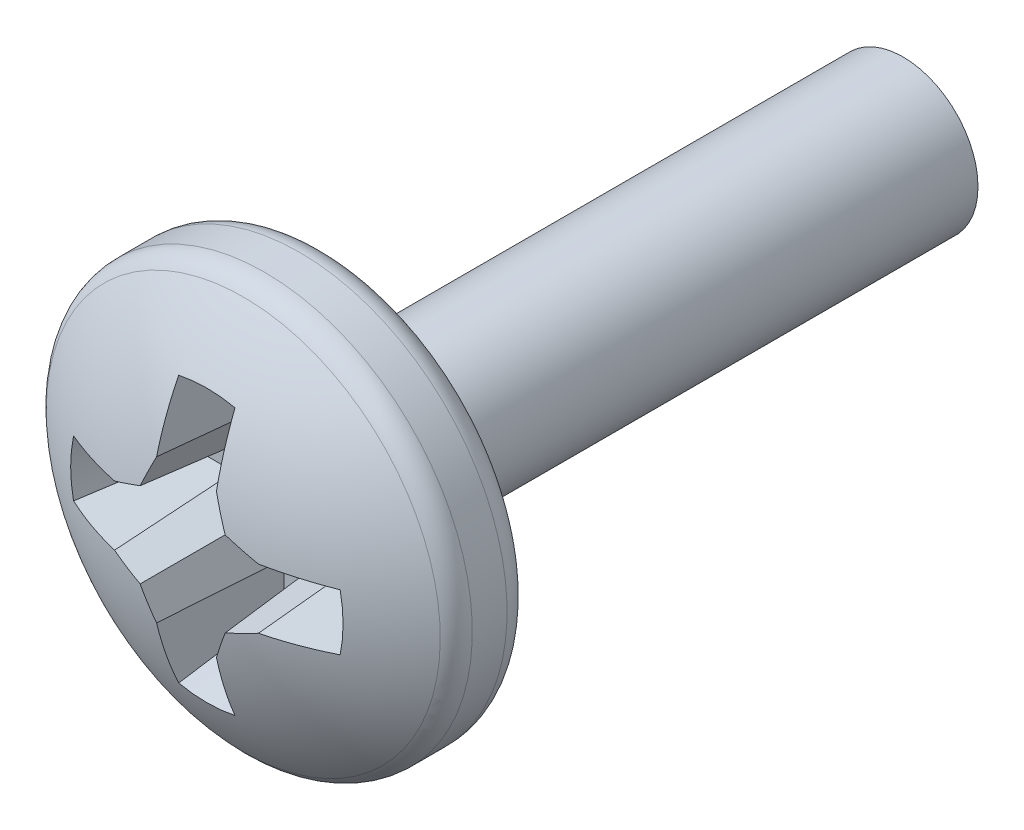
ISO-10303-21;
HEADER;
FILE_DESCRIPTION(('STEP AP214'),'2;1');
FILE_NAME('part.step','',(''),(''),'','','');
FILE_SCHEMA(('AUTOMOTIVE_DESIGN { 1 0 10303 214 1 1 1 1 }'));
ENDSEC;
DATA;
#1=APPLICATION_CONTEXT('core data for automotive mechanical design processes');
#2=APPLICATION_PROTOCOL_DEFINITION('international standard','automotive_design',2000,#1);
#3=PRODUCT_CONTEXT('',#1,'mechanical');
#4=PRODUCT('Part','Part','',(#3));
#5=PRODUCT_RELATED_PRODUCT_CATEGORY('part','',(#4));
#6=PRODUCT_DEFINITION_FORMATION('','',#4);
#7=PRODUCT_DEFINITION_CONTEXT('part definition',#1,'design');
#8=PRODUCT_DEFINITION('design','',#6,#7);
#9=PRODUCT_DEFINITION_SHAPE('','',#8);
#10=(LENGTH_UNIT() NAMED_UNIT(*) SI_UNIT(.MILLI.,.METRE.));
#11=(NAMED_UNIT(*) PLANE_ANGLE_UNIT() SI_UNIT($,.RADIAN.));
#12=(NAMED_UNIT(*) SI_UNIT($,.STERADIAN.) SOLID_ANGLE_UNIT());
#13=UNCERTAINTY_MEASURE_WITH_UNIT(LENGTH_MEASURE(1.E-05),#10,'distance_accuracy_value','');
#14=(GEOMETRIC_REPRESENTATION_CONTEXT(3) GLOBAL_UNCERTAINTY_ASSIGNED_CONTEXT((#13)) GLOBAL_UNIT_ASSIGNED_CONTEXT((#10,
#11,#12)) REPRESENTATION_CONTEXT('',''));
#15=CARTESIAN_POINT('',(0.,0.,0.));
#16=DIRECTION('',(0.,0.,1.));
#17=DIRECTION('',(1.,0.,0.));
#18=AXIS2_PLACEMENT_3D('',#15,#16,#17);
#19=CARTESIAN_POINT('',(0.,0.,9.525));
#20=DIRECTION('',(0.,0.,-1.));
#21=DIRECTION('',(-1.,0.,0.));
#22=AXIS2_PLACEMENT_3D('',#19,#20,#21);
#23=PLANE('',#22);
#24=CARTESIAN_POINT('',(0.,0.,9.525));
#25=DIRECTION('',(0.,0.,1.));
#26=DIRECTION('',(1.,0.,0.));
#27=AXIS2_PLACEMENT_3D('',#24,#25,#26);
#28=CIRCLE('',#27,1.23704425180958);
#29=CARTESIAN_POINT('',(1.23704425180958,0.,9.525));
#30=VERTEX_POINT('',#29);
#31=EDGE_CURVE('E491',#30,#30,#28,.T.);
#32=ORIENTED_EDGE('',*,*,#31,.T.);
#33=EDGE_LOOP('',(#32));
#34=FACE_BOUND('',#33,.T.);
#35=CARTESIAN_POINT('',(0.,0.,9.525));
#36=DIRECTION('',(0.,0.,1.));
#37=DIRECTION('',(0.,-1.,0.));
#38=AXIS2_PLACEMENT_3D('',#35,#36,#37);
#39=CIRCLE('',#38,2.985516);
#40=CARTESIAN_POINT('',(0.,-2.985516,9.525));
#41=VERTEX_POINT('',#40);
#42=EDGE_CURVE('E473',#41,#41,#39,.T.);
#43=ORIENTED_EDGE('',*,*,#42,.F.);
#44=EDGE_LOOP('',(#43));
#45=FACE_BOUND('',#44,.T.);
#46=ADVANCED_FACE('F34',(#34,#45),#23,.T.);
#47=CARTESIAN_POINT('',(0.,0.,0.));
#48=DIRECTION('',(0.,0.,1.));
#49=DIRECTION('',(1.,0.,0.));
#50=AXIS2_PLACEMENT_3D('',#47,#48,#49);
#51=CYLINDRICAL_SURFACE('',#50,1.23704425180958);
#52=CARTESIAN_POINT('',(0.,0.,0.));
#53=DIRECTION('',(0.,0.,1.));
#54=DIRECTION('',(1.,0.,0.));
#55=AXIS2_PLACEMENT_3D('',#52,#53,#54);
#56=CIRCLE('',#55,1.23704425180958);
#57=CARTESIAN_POINT('',(1.23704425180958,0.,0.));
#58=VERTEX_POINT('',#57);
#59=EDGE_CURVE('E452',#58,#58,#56,.T.);
#60=ORIENTED_EDGE('',*,*,#59,.T.);
#61=EDGE_LOOP('',(#60));
#62=FACE_BOUND('',#61,.T.);
#63=ORIENTED_EDGE('',*,*,#31,.F.);
#64=EDGE_LOOP('',(#63));
#65=FACE_BOUND('',#64,.T.);
#66=ADVANCED_FACE('F297',(#62,#65),#51,.T.);
#67=CARTESIAN_POINT('',(0.,0.,0.));
#68=DIRECTION('',(0.,0.,1.));
#69=DIRECTION('',(1.,0.,0.));
#70=AXIS2_PLACEMENT_3D('',#67,#68,#69);
#71=PLANE('',#70);
#72=ORIENTED_EDGE('',*,*,#59,.F.);
#73=EDGE_LOOP('',(#72));
#74=FACE_BOUND('',#73,.T.);
#75=ADVANCED_FACE('F303',(#74),#71,.F.);
#76=CARTESIAN_POINT('',(0.,0.,9.968484));
#77=DIRECTION('',(0.,0.,1.));
#78=DIRECTION('',(0.,-1.,0.));
#79=AXIS2_PLACEMENT_3D('',#76,#77,#78);
#80=TOROIDAL_SURFACE('',#79,2.985516,0.443484);
#81=ORIENTED_EDGE('',*,*,#42,.T.);
#82=EDGE_LOOP('',(#81));
#83=FACE_BOUND('',#82,.T.);
#84=CARTESIAN_POINT('',(0.,0.,9.968484));
#85=DIRECTION('',(0.,0.,1.));
#86=DIRECTION('',(0.,-1.,0.));
#87=AXIS2_PLACEMENT_3D('',#84,#85,#86);
#88=CIRCLE('',#87,3.429);
#89=CARTESIAN_POINT('',(0.,-3.429,9.968484));
#90=VERTEX_POINT('',#89);
#91=EDGE_CURVE('E475',#90,#90,#88,.T.);
#92=ORIENTED_EDGE('',*,*,#91,.F.);
#93=EDGE_LOOP('',(#92));
#94=FACE_BOUND('',#93,.T.);
#95=ADVANCED_FACE('F313',(#83,#94),#80,.T.);
#96=CARTESIAN_POINT('',(0.,0.,0.));
#97=DIRECTION('',(0.,0.,-1.));
#98=DIRECTION('',(-1.,0.,0.));
#99=AXIS2_PLACEMENT_3D('',#96,#97,#98);
#100=CYLINDRICAL_SURFACE('',#99,3.429);
#101=ORIENTED_EDGE('',*,*,#91,.T.);
#102=EDGE_LOOP('',(#101));
#103=FACE_BOUND('',#102,.T.);
#104=CARTESIAN_POINT('',(0.,0.,10.5423064995387));
#105=DIRECTION('',(0.,0.,1.));
#106=DIRECTION('',(0.,-1.,0.));
#107=AXIS2_PLACEMENT_3D('',#104,#105,#106);
#108=CIRCLE('',#107,3.429);
#109=CARTESIAN_POINT('',(0.,-3.429,10.5423064995387));
#110=VERTEX_POINT('',#109);
#111=EDGE_CURVE('E498',#110,#110,#108,.T.);
#112=ORIENTED_EDGE('',*,*,#111,.F.);
#113=EDGE_LOOP('',(#112));
#114=FACE_BOUND('',#113,.T.);
#115=ADVANCED_FACE('F311',(#103,#114),#100,.T.);
#116=CARTESIAN_POINT('',(0.,0.,6.60053041237114));
#117=DIRECTION('',(0.,0.,1.));
#118=DIRECTION('',(0.,1.,0.));
#119=AXIS2_PLACEMENT_3D('',#116,#117,#118);
#120=SPHERICAL_SURFACE('',#119,5.38826958762886);
#121=CARTESIAN_POINT('',(0.,0.,11.4968097698319));
#122=DIRECTION('',(0.,0.,-1.));
#123=DIRECTION('',(-1.,0.,0.));
#124=AXIS2_PLACEMENT_3D('',#121,#122,#123);
#125=CIRCLE('',#124,2.24942161514245);
#126=CARTESIAN_POINT('',(2.20084372883168,-0.46495643229479,11.4968097698319));
#127=VERTEX_POINT('',#126);
#128=CARTESIAN_POINT('',(2.20084372883169,0.464956432294775,11.4968097698319));
#129=VERTEX_POINT('',#128);
#130=EDGE_CURVE('E450',#127,#129,#125,.F.);
#131=ORIENTED_EDGE('',*,*,#130,.F.);
#132=CARTESIAN_POINT('',(0.,-0.036309571930155,6.59735373644977));
#133=DIRECTION('',(0.,0.996194698091746,0.0871557427476587));
#134=DIRECTION('',(0.,-0.0871557427476587,0.996194698091746));
#135=AXIS2_PLACEMENT_3D('',#132,#133,#134);
#136=CIRCLE('',#135,5.38814631136558);
#137=CARTESIAN_POINT('',(1.18791231699318,-0.494362421590186,11.8329217654927));
#138=VERTEX_POINT('',#137);
#139=EDGE_CURVE('E11',#138,#127,#136,.T.);
#140=ORIENTED_EDGE('',*,*,#139,.F.);
#141=CARTESIAN_POINT('',(0.172247929781571,-0.415843288169375,6.56115128096071));
#142=DIRECTION('',(-0.381227206369642,0.920363891963229,0.0871557427476588));
#143=DIRECTION('',(-0.923879532511292,-0.382683432365078,0.));
#144=AXIS2_PLACEMENT_3D('',#141,#142,#143);
#145=CIRCLE('',#144,5.36929263901177);
#146=CARTESIAN_POINT('',(0.701763399312058,-0.701763399312065,11.8966143818469));
#147=VERTEX_POINT('',#146);
#148=EDGE_CURVE('E44',#147,#138,#145,.T.);
#149=ORIENTED_EDGE('',*,*,#148,.F.);
#150=CARTESIAN_POINT('',(0.415843288169372,-0.172247929781579,6.56115128096071));
#151=DIRECTION('',(-0.920363891963226,0.381227206369651,0.0871557427476588));
#152=DIRECTION('',(-0.382683432365087,-0.923879532511288,0.));
#153=AXIS2_PLACEMENT_3D('',#150,#151,#152);
#154=CIRCLE('',#153,5.36929263901177);
#155=CARTESIAN_POINT('',(0.494362421590174,-1.18791231699318,11.8329217654927));
#156=VERTEX_POINT('',#155);
#157=EDGE_CURVE('E358',#156,#147,#154,.T.);
#158=ORIENTED_EDGE('',*,*,#157,.F.);
#159=CARTESIAN_POINT('',(0.0363095719301513,0.,6.59735373644977));
#160=DIRECTION('',(-0.996194698091746,0.,0.0871557427476587));
#161=DIRECTION('',(0.0871557427476587,0.,0.996194698091746));
#162=AXIS2_PLACEMENT_3D('',#159,#160,#161);
#163=CIRCLE('',#162,5.38814631136558);
#164=CARTESIAN_POINT('',(0.464956432294771,-2.20084372883169,11.4968097698319));
#165=VERTEX_POINT('',#164);
#166=EDGE_CURVE('E366',#165,#156,#163,.T.);
#167=ORIENTED_EDGE('',*,*,#166,.F.);
#168=CARTESIAN_POINT('',(0.,0.,11.4968097698319));
#169=DIRECTION('',(0.,0.,-1.));
#170=DIRECTION('',(0.,1.,0.));
#171=AXIS2_PLACEMENT_3D('',#168,#169,#170);
#172=CIRCLE('',#171,2.24942161514245);
#173=CARTESIAN_POINT('',(-0.464956432294793,-2.20084372883169,11.4968097698319));
#174=VERTEX_POINT('',#173);
#175=EDGE_CURVE('E262',#174,#165,#172,.F.);
#176=ORIENTED_EDGE('',*,*,#175,.F.);
#177=CARTESIAN_POINT('',(-0.0363095719301525,0.,6.59735373644977));
#178=DIRECTION('',(0.996194698091746,0.,0.0871557427476584));
#179=DIRECTION('',(0.0871557427476584,0.,-0.996194698091746));
#180=AXIS2_PLACEMENT_3D('',#177,#178,#179);
#181=CIRCLE('',#180,5.38814631136558);
#182=CARTESIAN_POINT('',(-0.494362421590186,-1.18791231699318,11.8329217654927));
#183=VERTEX_POINT('',#182);
#184=EDGE_CURVE('E260',#183,#174,#181,.T.);
#185=ORIENTED_EDGE('',*,*,#184,.F.);
#186=CARTESIAN_POINT('',(-0.415843288169373,-0.172247929781572,6.56115128096071));
#187=DIRECTION('',(0.920363891963231,0.381227206369638,0.0871557427476587));
#188=DIRECTION('',(-0.382683432365075,0.923879532511293,0.));
#189=AXIS2_PLACEMENT_3D('',#186,#187,#188);
#190=CIRCLE('',#189,5.36929263901177);
#191=CARTESIAN_POINT('',(-0.701763399312063,-0.70176339931206,11.8966143818469));
#192=VERTEX_POINT('',#191);
#193=EDGE_CURVE('E263',#192,#183,#190,.T.);
#194=ORIENTED_EDGE('',*,*,#193,.F.);
#195=CARTESIAN_POINT('',(-0.172247929781577,-0.415843288169374,6.56115128096071));
#196=DIRECTION('',(0.381227206369654,0.920363891963224,0.0871557427476591));
#197=DIRECTION('',(-0.923879532511287,0.38268343236509,0.));
#198=AXIS2_PLACEMENT_3D('',#195,#196,#197);
#199=CIRCLE('',#198,5.36929263901177);
#200=CARTESIAN_POINT('',(-1.18791231699318,-0.494362421590174,11.8329217654927));
#201=VERTEX_POINT('',#200);
#202=EDGE_CURVE('E265',#201,#192,#199,.T.);
#203=ORIENTED_EDGE('',*,*,#202,.F.);
#204=CARTESIAN_POINT('',(0.,-0.0363095719301537,6.59735373644977));
#205=DIRECTION('',(0.,0.996194698091745,0.0871557427476591));
#206=DIRECTION('',(0.,-0.0871557427476591,0.996194698091745));
#207=AXIS2_PLACEMENT_3D('',#204,#205,#206);
#208=CIRCLE('',#207,5.38814631136558);
#209=CARTESIAN_POINT('',(-2.20084372883169,-0.464956432294768,11.4968097698319));
#210=VERTEX_POINT('',#209);
#211=EDGE_CURVE('E230',#210,#201,#208,.T.);
#212=ORIENTED_EDGE('',*,*,#211,.F.);
#213=CARTESIAN_POINT('',(0.,0.,11.4968097698319));
#214=DIRECTION('',(0.,0.,-1.));
#215=DIRECTION('',(-1.,0.,0.));
#216=AXIS2_PLACEMENT_3D('',#213,#214,#215);
#217=CIRCLE('',#216,2.24942161514245);
#218=CARTESIAN_POINT('',(-2.20084372883168,0.464956432294797,11.4968097698319));
#219=VERTEX_POINT('',#218);
#220=EDGE_CURVE('E187',#219,#210,#217,.F.);
#221=ORIENTED_EDGE('',*,*,#220,.F.);
#222=CARTESIAN_POINT('',(0.,0.0363095719301501,6.59735373644977));
#223=DIRECTION('',(0.,-0.996194698091746,0.087155742747658));
#224=DIRECTION('',(0.,-0.087155742747658,-0.996194698091746));
#225=AXIS2_PLACEMENT_3D('',#222,#223,#224);
#226=CIRCLE('',#225,5.38814631136558);
#227=CARTESIAN_POINT('',(-1.18791231699317,0.494362421590185,11.8329217654927));
#228=VERTEX_POINT('',#227);
#229=EDGE_CURVE('E184',#228,#219,#226,.T.);
#230=ORIENTED_EDGE('',*,*,#229,.F.);
#231=CARTESIAN_POINT('',(-0.172247929781568,0.415843288169371,6.56115128096071));
#232=DIRECTION('',(0.381227206369635,-0.920363891963232,0.0871557427476582));
#233=DIRECTION('',(0.923879532511294,0.382683432365071,0.));
#234=AXIS2_PLACEMENT_3D('',#231,#232,#233);
#235=CIRCLE('',#234,5.36929263901177);
#236=CARTESIAN_POINT('',(-0.701763399312053,0.701763399312061,11.8966143818469));
#237=VERTEX_POINT('',#236);
#238=EDGE_CURVE('E183',#237,#228,#235,.T.);
#239=ORIENTED_EDGE('',*,*,#238,.F.);
#240=CARTESIAN_POINT('',(-0.415843288169371,0.172247929781576,6.56115128096071));
#241=DIRECTION('',(0.920363891963223,-0.381227206369657,0.0871557427476586));
#242=DIRECTION('',(0.382683432365093,0.923879532511285,0.));
#243=AXIS2_PLACEMENT_3D('',#240,#241,#242);
#244=CIRCLE('',#243,5.36929263901177);
#245=CARTESIAN_POINT('',(-0.494362421590166,1.18791231699318,11.8329217654927));
#246=VERTEX_POINT('',#245);
#247=EDGE_CURVE('E38',#246,#237,#244,.T.);
#248=ORIENTED_EDGE('',*,*,#247,.F.);
#249=CARTESIAN_POINT('',(-0.0363095719301513,0.,6.59735373644977));
#250=DIRECTION('',(0.996194698091746,0.,0.0871557427476587));
#251=DIRECTION('',(0.0871557427476587,0.,-0.996194698091746));
#252=AXIS2_PLACEMENT_3D('',#249,#250,#251);
#253=CIRCLE('',#252,5.38814631136558);
#254=CARTESIAN_POINT('',(-0.464956432294756,2.20084372883169,11.4968097698319));
#255=VERTEX_POINT('',#254);
#256=EDGE_CURVE('E162',#255,#246,#253,.T.);
#257=ORIENTED_EDGE('',*,*,#256,.F.);
#258=CARTESIAN_POINT('',(0.,0.,11.4968097698319));
#259=DIRECTION('',(0.,0.,-1.));
#260=DIRECTION('',(-1.,0.,0.));
#261=AXIS2_PLACEMENT_3D('',#258,#259,#260);
#262=CIRCLE('',#261,2.24942161514245);
#263=CARTESIAN_POINT('',(0.464956432294778,2.20084372883168,11.4968097698319));
#264=VERTEX_POINT('',#263);
#265=EDGE_CURVE('E171',#264,#255,#262,.F.);
#266=ORIENTED_EDGE('',*,*,#265,.F.);
#267=CARTESIAN_POINT('',(0.0363095719301525,0.,6.59735373644977));
#268=DIRECTION('',(-0.996194698091746,0.,0.0871557427476584));
#269=DIRECTION('',(0.0871557427476584,0.,0.996194698091746));
#270=AXIS2_PLACEMENT_3D('',#267,#268,#269);
#271=CIRCLE('',#270,5.38814631136558);
#272=CARTESIAN_POINT('',(0.494362421590177,1.18791231699318,11.8329217654927));
#273=VERTEX_POINT('',#272);
#274=EDGE_CURVE('E53',#273,#264,#271,.T.);
#275=ORIENTED_EDGE('',*,*,#274,.F.);
#276=CARTESIAN_POINT('',(0.415843288169372,0.17224792978157,6.56115128096071));
#277=DIRECTION('',(-0.920363891963228,-0.381227206369645,0.0871557427476584));
#278=DIRECTION('',(0.382683432365081,-0.92387953251129,0.));
#279=AXIS2_PLACEMENT_3D('',#276,#277,#278);
#280=CIRCLE('',#279,5.36929263901177);
#281=CARTESIAN_POINT('',(0.701763399312058,0.701763399312056,11.8966143818469));
#282=VERTEX_POINT('',#281);
#283=EDGE_CURVE('E435',#282,#273,#280,.T.);
#284=ORIENTED_EDGE('',*,*,#283,.F.);
#285=CARTESIAN_POINT('',(0.172247929781574,0.41584328816937,6.56115128096071));
#286=DIRECTION('',(-0.381227206369648,-0.920363891963227,0.0871557427476584));
#287=DIRECTION('',(0.923879532511289,-0.382683432365084,0.));
#288=AXIS2_PLACEMENT_3D('',#285,#286,#287);
#289=CIRCLE('',#288,5.36929263901177);
#290=CARTESIAN_POINT('',(1.18791231699318,0.494362421590174,11.8329217654927));
#291=VERTEX_POINT('',#290);
#292=EDGE_CURVE('E437',#291,#282,#289,.T.);
#293=ORIENTED_EDGE('',*,*,#292,.F.);
#294=CARTESIAN_POINT('',(0.,0.0363095719301488,6.59735373644977));
#295=DIRECTION('',(0.,-0.996194698091746,0.0871557427476584));
#296=DIRECTION('',(0.,-0.0871557427476584,-0.996194698091746));
#297=AXIS2_PLACEMENT_3D('',#294,#295,#296);
#298=CIRCLE('',#297,5.38814631136558);
#299=EDGE_CURVE('E447',#129,#291,#298,.T.);
#300=ORIENTED_EDGE('',*,*,#299,.F.);
#301=EDGE_LOOP('',(#131,#140,#149,#158,#167,#176,#185,#194,#203,#212,#221,#230,#239,#248,#257,
#266,#275,#284,#293,#300));
#302=FACE_BOUND('',#301,.T.);
#303=CARTESIAN_POINT('',(0.,0.,10.8958333805859));
#304=DIRECTION('',(0.,0.,1.));
#305=DIRECTION('',(0.,-1.,0.));
#306=AXIS2_PLACEMENT_3D('',#303,#304,#305);
#307=CIRCLE('',#306,3.25327858632053);
#308=CARTESIAN_POINT('',(0.,-3.25327858632054,10.8958333805859));
#309=VERTEX_POINT('',#308);
#310=EDGE_CURVE('E493',#309,#309,#307,.T.);
#311=ORIENTED_EDGE('',*,*,#310,.T.);
#312=EDGE_LOOP('',(#311));
#313=FACE_BOUND('',#312,.T.);
#314=ADVANCED_FACE('F180',(#302,#313),#120,.T.);
#315=CARTESIAN_POINT('',(0.,0.,10.5423064995387));
#316=DIRECTION('',(0.,0.,1.));
#317=DIRECTION('',(0.,-1.,0.));
#318=AXIS2_PLACEMENT_3D('',#315,#316,#317);
#319=TOROIDAL_SURFACE('',#318,2.985516,0.443484000000001);
#320=ORIENTED_EDGE('',*,*,#111,.T.);
#321=EDGE_LOOP('',(#320));
#322=FACE_BOUND('',#321,.T.);
#323=ORIENTED_EDGE('',*,*,#310,.F.);
#324=EDGE_LOOP('',(#323));
#325=FACE_BOUND('',#324,.T.);
#326=ADVANCED_FACE('F511',(#322,#325),#319,.T.);
#327=CARTESIAN_POINT('',(0.,0.,11.9888));
#328=DIRECTION('',(0.,0.,1.));
#329=DIRECTION('',(1.,0.,0.));
#330=AXIS2_PLACEMENT_3D('',#327,#328,#329);
#331=CONICAL_SURFACE('',#330,2.38125,0.26179938779915);
#332=ORIENTED_EDGE('',*,*,#265,.T.);
#333=CARTESIAN_POINT('',(-0.0367245839476239,0.937168091106453,6.60209734551587));
#334=CARTESIAN_POINT('',(-0.0515729130404379,0.982084876550983,6.77181452365535));
#335=CARTESIAN_POINT('',(-0.0664265517163799,1.02676943487832,6.94159239060769));
#336=CARTESIAN_POINT('',(-0.0961417507909936,1.11578945940655,7.2812386702175));
#337=CARTESIAN_POINT('',(-0.111003311176656,1.16012492617887,7.45110708272627));
#338=CARTESIAN_POINT('',(-0.155595811353238,1.29278068215684,7.9608016920555));
#339=CARTESIAN_POINT('',(-0.185334660454623,1.38075059865527,8.30071829270827));
#340=CARTESIAN_POINT('',(-0.244823791842432,1.55617358705389,8.98068217591679));
#341=CARTESIAN_POINT('',(-0.274574074083562,1.6436266609796,9.32072945795483));
#342=CARTESIAN_POINT('',(-0.334081806184161,1.81821208383946,10.0009059482834));
#343=CARTESIAN_POINT('',(-0.363839256048535,1.90534443255342,10.34103515663));
#344=CARTESIAN_POINT('',(-0.405491259074873,2.02714740848223,10.8171197297358));
#345=CARTESIAN_POINT('',(-0.417383839482949,2.06190690410988,10.9530525458149));
#346=CARTESIAN_POINT('',(-0.441169663877477,2.13139639003621,11.2249257627087));
#347=CARTESIAN_POINT('',(-0.453062907864384,2.1661263803144,11.3608661635286));
#348=CARTESIAN_POINT('',(-0.464956432294756,2.20084372883169,11.4968097698319));
#349=B_SPLINE_CURVE_WITH_KNOTS('',3,(#333,#334,#335,#336,#337,#338,#339,#340,#341,#342,#343,
#344,#345,#346,#347,#348),.UNSPECIFIED.,.F.,.F.,(4,2,2,2,2,2,2,4),(0.,0.52856085438551,
1.05712084340582,2.11423760848944,3.17135022794478,4.22846357303555,4.65089283057721,
5.07332238123299),.UNSPECIFIED.);
#350=CARTESIAN_POINT('',(-0.324778616184085,1.79089165428426,9.89457));
#351=VERTEX_POINT('',#350);
#352=EDGE_CURVE('E168',#351,#255,#349,.T.);
#353=ORIENTED_EDGE('',*,*,#352,.F.);
#354=CARTESIAN_POINT('',(0.,0.,9.89457));
#355=DIRECTION('',(0.,0.,1.));
#356=DIRECTION('',(1.,0.,0.));
#357=AXIS2_PLACEMENT_3D('',#354,#355,#356);
#358=CIRCLE('',#357,1.82010276273497);
#359=CARTESIAN_POINT('',(0.324778616184104,1.79089165428426,9.89457));
#360=VERTEX_POINT('',#359);
#361=EDGE_CURVE('E268',#360,#351,#358,.T.);
#362=ORIENTED_EDGE('',*,*,#361,.F.);
#363=CARTESIAN_POINT('',(0.324778616184104,1.79089165428426,9.89457));
#364=CARTESIAN_POINT('',(0.345127887711346,1.85053906967391,10.1271632378795));
#365=CARTESIAN_POINT('',(0.365478613282524,1.91012112516936,10.3597730955572));
#366=CARTESIAN_POINT('',(0.406182392639911,2.02918033466595,10.8250194225322));
#367=CARTESIAN_POINT('',(0.426535446425826,2.08865748868039,11.0576558918261));
#368=CARTESIAN_POINT('',(0.467243306320348,2.20753272517559,11.522948859554));
#369=CARTESIAN_POINT('',(0.487598112428854,2.26693080766093,11.7556053579867));
#370=CARTESIAN_POINT('',(0.528309135408767,2.38566341836104,12.2209344799461));
#371=CARTESIAN_POINT('',(0.548665352280352,2.44499794656782,12.4536071034746));
#372=CARTESIAN_POINT('',(0.569022100605802,2.50430844707825,12.6862858015487));
#373=B_SPLINE_CURVE_WITH_KNOTS('',3,(#363,#364,#365,#366,#367,#368,#369,#370,#371,#372),
.UNSPECIFIED.,.F.,.F.,(4,2,2,2,4),(0.,0.722940972625731,1.44588185359085,2.16882269264757,
2.89176362255185),.UNSPECIFIED.);
#374=EDGE_CURVE('E432',#360,#264,#373,.T.);
#375=ORIENTED_EDGE('',*,*,#374,.T.);
#376=EDGE_LOOP('',(#332,#353,#362,#375));
#377=FACE_BOUND('',#376,.T.);
#378=ADVANCED_FACE('F284',(#377),#331,.F.);
#379=CARTESIAN_POINT('',(0.508,0.,11.9888));
#380=DIRECTION('',(-0.996194698091746,0.,0.0871557427476584));
#381=DIRECTION('',(0.0871557427476584,0.,0.996194698091746));
#382=AXIS2_PLACEMENT_3D('',#379,#380,#381);
#383=PLANE('',#382);
#384=ORIENTED_EDGE('',*,*,#274,.T.);
#385=ORIENTED_EDGE('',*,*,#374,.F.);
#386=DIRECTION('',(0.,-1.,0.));
#387=VECTOR('',#386,1.);
#388=CARTESIAN_POINT('',(0.324778616184104,0.,9.89457));
#389=LINE('',#388,#387);
#390=CARTESIAN_POINT('',(0.324778616184104,1.1541800007906,9.89457));
#391=VERTEX_POINT('',#390);
#392=EDGE_CURVE('E271',#391,#360,#389,.F.);
#393=ORIENTED_EDGE('',*,*,#392,.F.);
#394=DIRECTION('',(0.0871426484044397,0.0173337504938598,0.996045029063886));
#395=VECTOR('',#394,1.);
#396=CARTESIAN_POINT('',(0.50620155031139,1.19026726611482,11.9682436259953));
#397=LINE('',#396,#395);
#398=EDGE_CURVE('E471',#391,#273,#397,.T.);
#399=ORIENTED_EDGE('',*,*,#398,.T.);
#400=EDGE_LOOP('',(#384,#385,#393,#399));
#401=FACE_BOUND('',#400,.T.);
#402=ADVANCED_FACE('F472',(#401),#383,.T.);
#403=CARTESIAN_POINT('',(0.854554628096495,0.353968116746255,11.9888));
#404=DIRECTION('',(-0.920363891963228,-0.381227206369645,0.0871557427476584));
#405=DIRECTION('',(0.382683432365081,-0.92387953251129,0.));
#406=AXIS2_PLACEMENT_3D('',#403,#404,#405);
#407=PLANE('',#406);
#408=ORIENTED_EDGE('',*,*,#283,.T.);
#409=ORIENTED_EDGE('',*,*,#398,.F.);
#410=DIRECTION('',(0.382683432365081,-0.92387953251129,0.));
#411=VECTOR('',#410,1.);
#412=CARTESIAN_POINT('',(0.685280141670593,0.283852328704908,9.89457));
#413=LINE('',#412,#411);
#414=CARTESIAN_POINT('',(0.567704657409831,0.56770465740983,9.89457));
#415=VERTEX_POINT('',#414);
#416=EDGE_CURVE('E689',#415,#391,#413,.F.);
#417=ORIENTED_EDGE('',*,*,#416,.F.);
#418=DIRECTION('',(0.0666626913468327,0.0666626913468325,0.995546167269401));
#419=VECTOR('',#418,1.);
#420=CARTESIAN_POINT('',(0.707014789072815,0.707014789072813,11.9750390725327));
#421=LINE('',#420,#419);
#422=EDGE_CURVE('E477',#415,#282,#421,.T.);
#423=ORIENTED_EDGE('',*,*,#422,.T.);
#424=EDGE_LOOP('',(#408,#409,#417,#423));
#425=FACE_BOUND('',#424,.T.);
#426=ADVANCED_FACE('F547',(#425),#407,.T.);
#427=CARTESIAN_POINT('',(0.353968116746257,0.854554628096493,11.9888));
#428=DIRECTION('',(-0.381227206369648,-0.920363891963227,0.0871557427476584));
#429=DIRECTION('',(0.923879532511289,-0.382683432365084,0.));
#430=AXIS2_PLACEMENT_3D('',#427,#428,#429);
#431=PLANE('',#430);
#432=ORIENTED_EDGE('',*,*,#292,.T.);
#433=ORIENTED_EDGE('',*,*,#422,.F.);
#434=DIRECTION('',(0.923879532511289,-0.382683432365084,0.));
#435=VECTOR('',#434,1.);
#436=CARTESIAN_POINT('',(0.28385232870491,0.685280141670592,9.89457));
#437=LINE('',#436,#435);
#438=CARTESIAN_POINT('',(1.1541800007906,0.3247786161841,9.89457));
#439=VERTEX_POINT('',#438);
#440=EDGE_CURVE('E489',#439,#415,#437,.F.);
#441=ORIENTED_EDGE('',*,*,#440,.F.);
#442=DIRECTION('',(0.01733375049386,0.0871426484044397,0.996045029063886));
#443=VECTOR('',#442,1.);
#444=CARTESIAN_POINT('',(1.19089709284668,0.509367903113651,12.0044352041342));
#445=LINE('',#444,#443);
#446=EDGE_CURVE('E480',#439,#291,#445,.T.);
#447=ORIENTED_EDGE('',*,*,#446,.T.);
#448=EDGE_LOOP('',(#432,#433,#441,#447));
#449=FACE_BOUND('',#448,.T.);
#450=ADVANCED_FACE('F488',(#449),#431,.T.);
#451=CARTESIAN_POINT('',(0.,0.507999999999996,11.9888));
#452=DIRECTION('',(0.,-0.996194698091746,0.0871557427476584));
#453=DIRECTION('',(0.,-0.0871557427476584,-0.996194698091746));
#454=AXIS2_PLACEMENT_3D('',#451,#452,#453);
#455=PLANE('',#454);
#456=ORIENTED_EDGE('',*,*,#299,.T.);
#457=ORIENTED_EDGE('',*,*,#446,.F.);
#458=DIRECTION('',(1.,0.,0.));
#459=VECTOR('',#458,1.);
#460=CARTESIAN_POINT('',(0.,0.3247786161841,9.89457));
#461=LINE('',#460,#459);
#462=CARTESIAN_POINT('',(1.79089165428426,0.3247786161841,9.89457));
#463=VERTEX_POINT('',#462);
#464=EDGE_CURVE('E449',#463,#439,#461,.F.);
#465=ORIENTED_EDGE('',*,*,#464,.F.);
#466=CARTESIAN_POINT('',(0.937168091106452,0.0367245839476312,6.60209734551587));
#467=CARTESIAN_POINT('',(0.982084876550983,0.0515729130404457,6.77181452365535));
#468=CARTESIAN_POINT('',(1.02676943487832,0.0664265517163882,6.94159239060769));
#469=CARTESIAN_POINT('',(1.11578945940655,0.0961417507910028,7.2812386702175));
#470=CARTESIAN_POINT('',(1.16012492617887,0.111003311176666,7.45110708272627));
#471=CARTESIAN_POINT('',(1.29278068215684,0.155595811353249,7.96080169205551));
#472=CARTESIAN_POINT('',(1.38075059865527,0.185334660454634,8.30071829270827));
#473=CARTESIAN_POINT('',(1.55617358705388,0.244823791842445,8.98068217591679));
#474=CARTESIAN_POINT('',(1.6436266609796,0.274574074083576,9.32072945795483));
#475=CARTESIAN_POINT('',(1.81821208383946,0.334081806184176,10.0009059482834));
#476=CARTESIAN_POINT('',(1.90534443255341,0.363839256048551,10.34103515663));
#477=CARTESIAN_POINT('',(2.02714740848223,0.40549125907489,10.8171197297358));
#478=CARTESIAN_POINT('',(2.06190690410988,0.417383839482967,10.9530525458149));
#479=CARTESIAN_POINT('',(2.13139639003621,0.441169663877496,11.2249257627087));
#480=CARTESIAN_POINT('',(2.16612638031439,0.453062907864403,11.3608661635286));
#481=CARTESIAN_POINT('',(2.20084372883169,0.464956432294775,11.4968097698319));
#482=B_SPLINE_CURVE_WITH_KNOTS('',3,(#466,#467,#468,#469,#470,#471,#472,#473,#474,#475,#476,
#477,#478,#479,#480,#481),.UNSPECIFIED.,.F.,.F.,(4,2,2,2,2,2,2,4),(0.,0.528560854385512,
1.05712084340582,2.11423760848944,3.17135022794478,4.22846357303555,4.65089283057721,
5.07332238123299),.UNSPECIFIED.);
#483=EDGE_CURVE('E270',#463,#129,#482,.T.);
#484=ORIENTED_EDGE('',*,*,#483,.T.);
#485=EDGE_LOOP('',(#456,#457,#465,#484));
#486=FACE_BOUND('',#485,.T.);
#487=ADVANCED_FACE('F322',(#486),#455,.T.);
#488=CARTESIAN_POINT('',(0.,0.,11.9888));
#489=DIRECTION('',(0.,0.,1.));
#490=DIRECTION('',(1.,0.,0.));
#491=AXIS2_PLACEMENT_3D('',#488,#489,#490);
#492=CONICAL_SURFACE('',#491,2.38125,0.26179938779915);
#493=ORIENTED_EDGE('',*,*,#130,.T.);
#494=ORIENTED_EDGE('',*,*,#483,.F.);
#495=CARTESIAN_POINT('',(0.,0.,9.89457));
#496=DIRECTION('',(0.,0.,1.));
#497=DIRECTION('',(1.,0.,0.));
#498=AXIS2_PLACEMENT_3D('',#495,#496,#497);
#499=CIRCLE('',#498,1.82010276273497);
#500=CARTESIAN_POINT('',(1.79089165428426,-0.324778616184114,9.89457));
#501=VERTEX_POINT('',#500);
#502=EDGE_CURVE('E338',#501,#463,#499,.T.);
#503=ORIENTED_EDGE('',*,*,#502,.F.);
#504=CARTESIAN_POINT('',(1.79089165428426,-0.324778616184114,9.89457));
#505=CARTESIAN_POINT('',(1.85053906967391,-0.345127887711357,10.1271632378795));
#506=CARTESIAN_POINT('',(1.91012112516936,-0.365478613282534,10.3597730955572));
#507=CARTESIAN_POINT('',(2.02918033466595,-0.406182392639923,10.8250194225322));
#508=CARTESIAN_POINT('',(2.08865748868039,-0.426535446425837,11.0576558918261));
#509=CARTESIAN_POINT('',(2.20753272517559,-0.46724330632036,11.522948859554));
#510=CARTESIAN_POINT('',(2.26693080766093,-0.487598112428866,11.7556053579867));
#511=CARTESIAN_POINT('',(2.38566341836104,-0.52830913540878,12.2209344799461));
#512=CARTESIAN_POINT('',(2.44499794656782,-0.548665352280366,12.4536071034746));
#513=CARTESIAN_POINT('',(2.50430844707824,-0.569022100605816,12.6862858015487));
#514=B_SPLINE_CURVE_WITH_KNOTS('',3,(#504,#505,#506,#507,#508,#509,#510,#511,#512,#513),
.UNSPECIFIED.,.F.,.F.,(4,2,2,2,4),(0.,0.722940972625732,1.44588185359085,2.16882269264757,
2.89176362255185),.UNSPECIFIED.);
#515=EDGE_CURVE('E332',#501,#127,#514,.T.);
#516=ORIENTED_EDGE('',*,*,#515,.T.);
#517=EDGE_LOOP('',(#493,#494,#503,#516));
#518=FACE_BOUND('',#517,.T.);
#519=ADVANCED_FACE('F318',(#518),#492,.F.);
#520=CARTESIAN_POINT('',(0.,0.,9.89457));
#521=DIRECTION('',(0.,0.,1.));
#522=DIRECTION('',(1.,0.,0.));
#523=AXIS2_PLACEMENT_3D('',#520,#521,#522);
#524=PLANE('',#523);
#525=DIRECTION('',(-1.,0.,0.));
#526=VECTOR('',#525,1.);
#527=CARTESIAN_POINT('',(0.,-0.324778616184108,9.89457));
#528=LINE('',#527,#526);
#529=CARTESIAN_POINT('',(1.15418000079061,-0.324778616184112,9.89457));
#530=VERTEX_POINT('',#529);
#531=EDGE_CURVE('E340',#530,#501,#528,.F.);
#532=ORIENTED_EDGE('',*,*,#531,.T.);
#533=ORIENTED_EDGE('',*,*,#502,.T.);
#534=ORIENTED_EDGE('',*,*,#464,.T.);
#535=ORIENTED_EDGE('',*,*,#440,.T.);
#536=ORIENTED_EDGE('',*,*,#416,.T.);
#537=ORIENTED_EDGE('',*,*,#392,.T.);
#538=ORIENTED_EDGE('',*,*,#361,.T.);
#539=DIRECTION('',(0.,1.,0.));
#540=VECTOR('',#539,1.);
#541=CARTESIAN_POINT('',(-0.324778616184104,0.,9.89457));
#542=LINE('',#541,#540);
#543=CARTESIAN_POINT('',(-0.324778616184092,1.1541800007906,9.89457));
#544=VERTEX_POINT('',#543);
#545=EDGE_CURVE('E282',#351,#544,#542,.F.);
#546=ORIENTED_EDGE('',*,*,#545,.T.);
#547=DIRECTION('',(0.382683432365093,0.923879532511285,0.));
#548=VECTOR('',#547,1.);
#549=CARTESIAN_POINT('',(-0.685280141670591,0.283852328704918,9.89457));
#550=LINE('',#549,#548);
#551=CARTESIAN_POINT('',(-0.567704657409827,0.567704657409834,9.89457));
#552=VERTEX_POINT('',#551);
#553=EDGE_CURVE('E175',#544,#552,#550,.F.);
#554=ORIENTED_EDGE('',*,*,#553,.T.);
#555=DIRECTION('',(0.923879532511294,0.382683432365071,0.));
#556=VECTOR('',#555,1.);
#557=CARTESIAN_POINT('',(-0.2838523287049,0.685280141670594,9.89457));
#558=LINE('',#557,#556);
#559=CARTESIAN_POINT('',(-1.1541800007906,0.324778616184112,9.89457));
#560=VERTEX_POINT('',#559);
#561=EDGE_CURVE('E426',#552,#560,#558,.F.);
#562=ORIENTED_EDGE('',*,*,#561,.T.);
#563=DIRECTION('',(1.,0.,0.));
#564=VECTOR('',#563,1.);
#565=CARTESIAN_POINT('',(0.,0.3247786161841,9.89457));
#566=LINE('',#565,#564);
#567=CARTESIAN_POINT('',(-1.79089165428425,0.324778616184119,9.89457));
#568=VERTEX_POINT('',#567);
#569=EDGE_CURVE('E200',#560,#568,#566,.F.);
#570=ORIENTED_EDGE('',*,*,#569,.T.);
#571=CARTESIAN_POINT('',(0.,0.,9.89457));
#572=DIRECTION('',(0.,0.,1.));
#573=DIRECTION('',(1.,0.,0.));
#574=AXIS2_PLACEMENT_3D('',#571,#572,#573);
#575=CIRCLE('',#574,1.82010276273497);
#576=CARTESIAN_POINT('',(-1.79089165428426,-0.324778616184095,9.89457));
#577=VERTEX_POINT('',#576);
#578=EDGE_CURVE('E198',#568,#577,#575,.T.);
#579=ORIENTED_EDGE('',*,*,#578,.T.);
#580=DIRECTION('',(-1.,0.,0.));
#581=VECTOR('',#580,1.);
#582=CARTESIAN_POINT('',(0.,-0.324778616184108,9.89457));
#583=LINE('',#582,#581);
#584=CARTESIAN_POINT('',(-1.15418000079061,-0.3247786161841,9.89457));
#585=VERTEX_POINT('',#584);
#586=EDGE_CURVE('E232',#577,#585,#583,.F.);
#587=ORIENTED_EDGE('',*,*,#586,.T.);
#588=DIRECTION('',(-0.923879532511287,0.38268343236509,0.));
#589=VECTOR('',#588,1.);
#590=CARTESIAN_POINT('',(-0.283852328704917,-0.685280141670596,9.89457));
#591=LINE('',#590,#589);
#592=CARTESIAN_POINT('',(-0.567704657409836,-0.567704657409833,9.89457));
#593=VERTEX_POINT('',#592);
#594=EDGE_CURVE('E414',#585,#593,#591,.F.);
#595=ORIENTED_EDGE('',*,*,#594,.T.);
#596=DIRECTION('',(-0.382683432365075,0.923879532511293,0.));
#597=VECTOR('',#596,1.);
#598=CARTESIAN_POINT('',(-0.685280141670597,-0.283852328704904,9.89457));
#599=LINE('',#598,#597);
#600=CARTESIAN_POINT('',(-0.324778616184112,-1.15418000079061,9.89457));
#601=VERTEX_POINT('',#600);
#602=EDGE_CURVE('E413',#593,#601,#599,.F.);
#603=ORIENTED_EDGE('',*,*,#602,.T.);
#604=DIRECTION('',(0.,1.,0.));
#605=VECTOR('',#604,1.);
#606=CARTESIAN_POINT('',(-0.324778616184104,0.,9.89457));
#607=LINE('',#606,#605);
#608=CARTESIAN_POINT('',(-0.324778616184116,-1.79089165428426,9.89457));
#609=VERTEX_POINT('',#608);
#610=EDGE_CURVE('E229',#601,#609,#607,.F.);
#611=ORIENTED_EDGE('',*,*,#610,.T.);
#612=CARTESIAN_POINT('',(0.,0.,9.89457));
#613=DIRECTION('',(0.,0.,1.));
#614=DIRECTION('',(1.,0.,0.));
#615=AXIS2_PLACEMENT_3D('',#612,#613,#614);
#616=CIRCLE('',#615,1.82010276273497);
#617=CARTESIAN_POINT('',(0.324778616184098,-1.79089165428426,9.89457));
#618=VERTEX_POINT('',#617);
#619=EDGE_CURVE('E257',#609,#618,#616,.T.);
#620=ORIENTED_EDGE('',*,*,#619,.T.);
#621=DIRECTION('',(0.,-1.,0.));
#622=VECTOR('',#621,1.);
#623=CARTESIAN_POINT('',(0.324778616184104,0.,9.89457));
#624=LINE('',#623,#622);
#625=CARTESIAN_POINT('',(0.3247786161841,-1.15418000079061,9.89457));
#626=VERTEX_POINT('',#625);
#627=EDGE_CURVE('E377',#618,#626,#624,.F.);
#628=ORIENTED_EDGE('',*,*,#627,.T.);
#629=DIRECTION('',(-0.382683432365087,-0.923879532511288,0.));
#630=VECTOR('',#629,1.);
#631=CARTESIAN_POINT('',(0.685280141670595,-0.283852328704914,9.89457));
#632=LINE('',#631,#630);
#633=CARTESIAN_POINT('',(0.567704657409831,-0.567704657409837,9.89457));
#634=VERTEX_POINT('',#633);
#635=EDGE_CURVE('E408',#626,#634,#632,.F.);
#636=ORIENTED_EDGE('',*,*,#635,.T.);
#637=DIRECTION('',(-0.923879532511292,-0.382683432365078,0.));
#638=VECTOR('',#637,1.);
#639=CARTESIAN_POINT('',(0.283852328704907,-0.685280141670598,9.89457));
#640=LINE('',#639,#638);
#641=EDGE_CURVE('E370',#634,#530,#640,.F.);
#642=ORIENTED_EDGE('',*,*,#641,.T.);
#643=EDGE_LOOP('',(#532,#533,#534,#535,#536,#537,#538,#546,#554,#562,#570,#579,#587,#595,#603,
#611,#620,#628,#636,#642));
#644=FACE_BOUND('',#643,.T.);
#645=ADVANCED_FACE('F321',(#644),#524,.T.);
#646=CARTESIAN_POINT('',(0.,-0.508000000000004,11.9888));
#647=DIRECTION('',(0.,0.996194698091746,0.0871557427476587));
#648=DIRECTION('',(0.,-0.0871557427476587,0.996194698091746));
#649=AXIS2_PLACEMENT_3D('',#646,#647,#648);
#650=PLANE('',#649);
#651=ORIENTED_EDGE('',*,*,#139,.T.);
#652=ORIENTED_EDGE('',*,*,#515,.F.);
#653=ORIENTED_EDGE('',*,*,#531,.F.);
#654=DIRECTION('',(0.0173337504938599,-0.0871426484044401,0.996045029063886));
#655=VECTOR('',#654,1.);
#656=CARTESIAN_POINT('',(1.19026726611483,-0.506201550311399,11.9682436259953));
#657=LINE('',#656,#655);
#658=EDGE_CURVE('E339',#530,#138,#657,.T.);
#659=ORIENTED_EDGE('',*,*,#658,.T.);
#660=EDGE_LOOP('',(#651,#652,#653,#659));
#661=FACE_BOUND('',#660,.T.);
#662=ADVANCED_FACE('F343',(#661),#650,.T.);
#663=CARTESIAN_POINT('',(0.353968116746256,-0.8545546280965,11.9888));
#664=DIRECTION('',(-0.381227206369642,0.920363891963229,0.0871557427476588));
#665=DIRECTION('',(-0.923879532511292,-0.382683432365078,0.));
#666=AXIS2_PLACEMENT_3D('',#663,#664,#665);
#667=PLANE('',#666);
#668=ORIENTED_EDGE('',*,*,#148,.T.);
#669=ORIENTED_EDGE('',*,*,#658,.F.);
#670=ORIENTED_EDGE('',*,*,#641,.F.);
#671=DIRECTION('',(0.0666626913468326,-0.0666626913468333,0.995546167269401));
#672=VECTOR('',#671,1.);
#673=CARTESIAN_POINT('',(0.707014789072815,-0.707014789072822,11.9750390725327));
#674=LINE('',#673,#672);
#675=EDGE_CURVE('E361',#634,#147,#674,.T.);
#676=ORIENTED_EDGE('',*,*,#675,.T.);
#677=EDGE_LOOP('',(#668,#669,#670,#676));
#678=FACE_BOUND('',#677,.T.);
#679=ADVANCED_FACE('F240',(#678),#667,.T.);
#680=CARTESIAN_POINT('',(0.854554628096497,-0.353968116746265,11.9888));
#681=DIRECTION('',(-0.920363891963226,0.381227206369651,0.0871557427476588));
#682=DIRECTION('',(-0.382683432365087,-0.923879532511288,0.));
#683=AXIS2_PLACEMENT_3D('',#680,#681,#682);
#684=PLANE('',#683);
#685=ORIENTED_EDGE('',*,*,#157,.T.);
#686=ORIENTED_EDGE('',*,*,#675,.F.);
#687=ORIENTED_EDGE('',*,*,#635,.F.);
#688=DIRECTION('',(0.08714264840444,-0.0173337504938606,0.996045029063886));
#689=VECTOR('',#688,1.);
#690=CARTESIAN_POINT('',(0.509367903113652,-1.19089709284669,12.0044352041342));
#691=LINE('',#690,#689);
#692=EDGE_CURVE('E363',#626,#156,#691,.T.);
#693=ORIENTED_EDGE('',*,*,#692,.T.);
#694=EDGE_LOOP('',(#685,#686,#687,#693));
#695=FACE_BOUND('',#694,.T.);
#696=ADVANCED_FACE('F347',(#695),#684,.T.);
#697=CARTESIAN_POINT('',(0.508000000000001,0.,11.9888));
#698=DIRECTION('',(-0.996194698091746,0.,0.0871557427476587));
#699=DIRECTION('',(0.0871557427476587,0.,0.996194698091746));
#700=AXIS2_PLACEMENT_3D('',#697,#698,#699);
#701=PLANE('',#700);
#702=ORIENTED_EDGE('',*,*,#166,.T.);
#703=ORIENTED_EDGE('',*,*,#692,.F.);
#704=ORIENTED_EDGE('',*,*,#627,.F.);
#705=CARTESIAN_POINT('',(0.0367245839476304,-0.937168091106453,6.60209734551587));
#706=CARTESIAN_POINT('',(0.0515729130404449,-0.982084876550985,6.77181452365535));
#707=CARTESIAN_POINT('',(0.0664265517163872,-1.02676943487832,6.94159239060769));
#708=CARTESIAN_POINT('',(0.0961417507910016,-1.11578945940655,7.2812386702175));
#709=CARTESIAN_POINT('',(0.111003311176664,-1.16012492617887,7.45110708272627));
#710=CARTESIAN_POINT('',(0.155595811353247,-1.29278068215684,7.96080169205551));
#711=CARTESIAN_POINT('',(0.185334660454633,-1.38075059865527,8.30071829270827));
#712=CARTESIAN_POINT('',(0.244823791842443,-1.55617358705389,8.98068217591679));
#713=CARTESIAN_POINT('',(0.274574074083574,-1.6436266609796,9.32072945795483));
#714=CARTESIAN_POINT('',(0.334081806184173,-1.81821208383947,10.0009059482834));
#715=CARTESIAN_POINT('',(0.363839256048548,-1.90534443255342,10.34103515663));
#716=CARTESIAN_POINT('',(0.405491259074887,-2.02714740848223,10.8171197297358));
#717=CARTESIAN_POINT('',(0.417383839482964,-2.06190690410988,10.9530525458149));
#718=CARTESIAN_POINT('',(0.441169663877492,-2.13139639003621,11.2249257627087));
#719=CARTESIAN_POINT('',(0.4530629078644,-2.1661263803144,11.3608661635285));
#720=CARTESIAN_POINT('',(0.464956432294771,-2.20084372883169,11.4968097698319));
#721=B_SPLINE_CURVE_WITH_KNOTS('',3,(#705,#706,#707,#708,#709,#710,#711,#712,#713,#714,#715,
#716,#717,#718,#719,#720),.UNSPECIFIED.,.F.,.F.,(4,2,2,2,2,2,2,4),(0.,0.528560854385512,
1.05712084340582,2.11423760848944,3.17135022794478,4.22846357303555,4.65089283057721,
5.07332238123299),.UNSPECIFIED.);
#722=EDGE_CURVE('E395',#618,#165,#721,.T.);
#723=ORIENTED_EDGE('',*,*,#722,.T.);
#724=EDGE_LOOP('',(#702,#703,#704,#723));
#725=FACE_BOUND('',#724,.T.);
#726=ADVANCED_FACE('F215',(#725),#701,.T.);
#727=CARTESIAN_POINT('',(0.,0.,11.9888));
#728=DIRECTION('',(0.,0.,1.));
#729=DIRECTION('',(0.,-1.,0.));
#730=AXIS2_PLACEMENT_3D('',#727,#728,#729);
#731=CONICAL_SURFACE('',#730,2.38125,0.26179938779915);
#732=ORIENTED_EDGE('',*,*,#175,.T.);
#733=ORIENTED_EDGE('',*,*,#722,.F.);
#734=ORIENTED_EDGE('',*,*,#619,.F.);
#735=CARTESIAN_POINT('',(-0.324778616184117,-1.79089165428426,9.89457));
#736=CARTESIAN_POINT('',(-0.345127887711359,-1.85053906967391,10.1271632378795));
#737=CARTESIAN_POINT('',(-0.365478613282537,-1.91012112516936,10.3597730955572));
#738=CARTESIAN_POINT('',(-0.406182392639926,-2.02918033466595,10.8250194225322));
#739=CARTESIAN_POINT('',(-0.426535446425841,-2.08865748868039,11.0576558918261));
#740=CARTESIAN_POINT('',(-0.467243306320364,-2.20753272517559,11.522948859554));
#741=CARTESIAN_POINT('',(-0.48759811242887,-2.26693080766093,11.7556053579867));
#742=CARTESIAN_POINT('',(-0.528309135408784,-2.38566341836104,12.2209344799461));
#743=CARTESIAN_POINT('',(-0.54866535228037,-2.44499794656783,12.4536071034746));
#744=CARTESIAN_POINT('',(-0.56902210060582,-2.50430844707825,12.6862858015487));
#745=B_SPLINE_CURVE_WITH_KNOTS('',3,(#735,#736,#737,#738,#739,#740,#741,#742,#743,#744),
.UNSPECIFIED.,.F.,.F.,(4,2,2,2,4),(0.,0.722940972625732,1.44588185359085,2.16882269264757,
2.89176362255185),.UNSPECIFIED.);
#746=EDGE_CURVE('E250',#609,#174,#745,.T.);
#747=ORIENTED_EDGE('',*,*,#746,.T.);
#748=EDGE_LOOP('',(#732,#733,#734,#747));
#749=FACE_BOUND('',#748,.T.);
#750=ADVANCED_FACE('F212',(#749),#731,.F.);
#751=CARTESIAN_POINT('',(-0.508,0.,11.9888));
#752=DIRECTION('',(0.996194698091746,0.,0.0871557427476584));
#753=DIRECTION('',(0.0871557427476584,0.,-0.996194698091746));
#754=AXIS2_PLACEMENT_3D('',#751,#752,#753);
#755=PLANE('',#754);
#756=ORIENTED_EDGE('',*,*,#184,.T.);
#757=ORIENTED_EDGE('',*,*,#746,.F.);
#758=ORIENTED_EDGE('',*,*,#610,.F.);
#759=DIRECTION('',(-0.0871426484044398,-0.01733375049386,0.996045029063886));
#760=VECTOR('',#759,1.);
#761=CARTESIAN_POINT('',(-0.506201550311398,-1.19026726611483,11.9682436259953));
#762=LINE('',#761,#760);
#763=EDGE_CURVE('E258',#601,#183,#762,.T.);
#764=ORIENTED_EDGE('',*,*,#763,.T.);
#765=EDGE_LOOP('',(#756,#757,#758,#764));
#766=FACE_BOUND('',#765,.T.);
#767=ADVANCED_FACE('F242',(#766),#755,.T.);
#768=CARTESIAN_POINT('',(-0.854554628096497,-0.353968116746258,11.9888));
#769=DIRECTION('',(0.920363891963231,0.381227206369638,0.0871557427476587));
#770=DIRECTION('',(-0.382683432365075,0.923879532511293,0.));
#771=AXIS2_PLACEMENT_3D('',#768,#769,#770);
#772=PLANE('',#771);
#773=ORIENTED_EDGE('',*,*,#193,.T.);
#774=ORIENTED_EDGE('',*,*,#763,.F.);
#775=ORIENTED_EDGE('',*,*,#602,.F.);
#776=DIRECTION('',(-0.0666626913468331,-0.0666626913468328,0.995546167269401));
#777=VECTOR('',#776,1.);
#778=CARTESIAN_POINT('',(-0.70701478907282,-0.707014789072817,11.9750390725327));
#779=LINE('',#778,#777);
#780=EDGE_CURVE('E381',#593,#192,#779,.T.);
#781=ORIENTED_EDGE('',*,*,#780,.T.);
#782=EDGE_LOOP('',(#773,#774,#775,#781));
#783=FACE_BOUND('',#782,.T.);
#784=ADVANCED_FACE('F246',(#783),#772,.T.);
#785=CARTESIAN_POINT('',(-0.353968116746263,-0.8545546280965,11.9888));
#786=DIRECTION('',(0.381227206369654,0.920363891963224,0.0871557427476591));
#787=DIRECTION('',(-0.923879532511287,0.38268343236509,0.));
#788=AXIS2_PLACEMENT_3D('',#785,#786,#787);
#789=PLANE('',#788);
#790=ORIENTED_EDGE('',*,*,#202,.T.);
#791=ORIENTED_EDGE('',*,*,#780,.F.);
#792=ORIENTED_EDGE('',*,*,#594,.F.);
#793=DIRECTION('',(-0.0173337504938605,-0.0871426484044403,0.996045029063886));
#794=VECTOR('',#793,1.);
#795=CARTESIAN_POINT('',(-1.19089709284669,-0.509367903113652,12.0044352041342));
#796=LINE('',#795,#794);
#797=EDGE_CURVE('E228',#585,#201,#796,.T.);
#798=ORIENTED_EDGE('',*,*,#797,.T.);
#799=EDGE_LOOP('',(#790,#791,#792,#798));
#800=FACE_BOUND('',#799,.T.);
#801=ADVANCED_FACE('F238',(#800),#789,.T.);
#802=CARTESIAN_POINT('',(0.,-0.508000000000005,11.9888));
#803=DIRECTION('',(0.,0.996194698091745,0.0871557427476591));
#804=DIRECTION('',(0.,-0.0871557427476591,0.996194698091745));
#805=AXIS2_PLACEMENT_3D('',#802,#803,#804);
#806=PLANE('',#805);
#807=ORIENTED_EDGE('',*,*,#211,.T.);
#808=ORIENTED_EDGE('',*,*,#797,.F.);
#809=ORIENTED_EDGE('',*,*,#586,.F.);
#810=CARTESIAN_POINT('',(-0.937168091106451,-0.0367245839476299,6.60209734551587));
#811=CARTESIAN_POINT('',(-0.982084876550982,-0.0515729130404443,6.77181452365535));
#812=CARTESIAN_POINT('',(-1.02676943487831,-0.0664265517163865,6.94159239060769));
#813=CARTESIAN_POINT('',(-1.11578945940655,-0.0961417507910006,7.2812386702175));
#814=CARTESIAN_POINT('',(-1.16012492617887,-0.111003311176663,7.45110708272627));
#815=CARTESIAN_POINT('',(-1.29278068215684,-0.155595811353246,7.96080169205551));
#816=CARTESIAN_POINT('',(-1.38075059865527,-0.185334660454631,8.30071829270828));
#817=CARTESIAN_POINT('',(-1.55617358705389,-0.244823791842441,8.98068217591679));
#818=CARTESIAN_POINT('',(-1.6436266609796,-0.274574074083572,9.32072945795483));
#819=CARTESIAN_POINT('',(-1.81821208383946,-0.334081806184171,10.0009059482834));
#820=CARTESIAN_POINT('',(-1.90534443255341,-0.363839256048546,10.34103515663));
#821=CARTESIAN_POINT('',(-2.02714740848223,-0.405491259074885,10.8171197297358));
#822=CARTESIAN_POINT('',(-2.06190690410988,-0.417383839482961,10.9530525458149));
#823=CARTESIAN_POINT('',(-2.13139639003621,-0.441169663877489,11.2249257627087));
#824=CARTESIAN_POINT('',(-2.1661263803144,-0.453062907864396,11.3608661635286));
#825=CARTESIAN_POINT('',(-2.20084372883169,-0.464956432294768,11.4968097698319));
#826=B_SPLINE_CURVE_WITH_KNOTS('',3,(#810,#811,#812,#813,#814,#815,#816,#817,#818,#819,#820,
#821,#822,#823,#824,#825),.UNSPECIFIED.,.F.,.F.,(4,2,2,2,2,2,2,4),(0.,0.528560854385511,
1.05712084340582,2.11423760848944,3.17135022794478,4.22846357303555,4.65089283057721,
5.07332238123299),.UNSPECIFIED.);
#827=EDGE_CURVE('E220',#577,#210,#826,.T.);
#828=ORIENTED_EDGE('',*,*,#827,.T.);
#829=EDGE_LOOP('',(#807,#808,#809,#828));
#830=FACE_BOUND('',#829,.T.);
#831=ADVANCED_FACE('F210',(#830),#806,.T.);
#832=CARTESIAN_POINT('',(0.,0.,11.9888));
#833=DIRECTION('',(0.,0.,1.));
#834=DIRECTION('',(1.,0.,0.));
#835=AXIS2_PLACEMENT_3D('',#832,#833,#834);
#836=CONICAL_SURFACE('',#835,2.38125,0.26179938779915);
#837=ORIENTED_EDGE('',*,*,#220,.T.);
#838=ORIENTED_EDGE('',*,*,#827,.F.);
#839=ORIENTED_EDGE('',*,*,#578,.F.);
#840=CARTESIAN_POINT('',(-1.79089165428425,0.324778616184119,9.89457));
#841=CARTESIAN_POINT('',(-1.8505390696739,0.345127887711362,10.1271632378795));
#842=CARTESIAN_POINT('',(-1.91012112516936,0.36547861328254,10.3597730955572));
#843=CARTESIAN_POINT('',(-2.02918033466595,0.406182392639929,10.8250194225322));
#844=CARTESIAN_POINT('',(-2.08865748868039,0.426535446425844,11.0576558918261));
#845=CARTESIAN_POINT('',(-2.20753272517558,0.467243306320367,11.522948859554));
#846=CARTESIAN_POINT('',(-2.26693080766092,0.487598112428873,11.7556053579867));
#847=CARTESIAN_POINT('',(-2.38566341836104,0.528309135408788,12.2209344799461));
#848=CARTESIAN_POINT('',(-2.44499794656782,0.548665352280373,12.4536071034746));
#849=CARTESIAN_POINT('',(-2.50430844707824,0.569022100605824,12.6862858015487));
#850=B_SPLINE_CURVE_WITH_KNOTS('',3,(#840,#841,#842,#843,#844,#845,#846,#847,#848,#849),
.UNSPECIFIED.,.F.,.F.,(4,2,2,2,4),(0.,0.722940972625731,1.44588185359085,2.16882269264757,
2.89176362255185),.UNSPECIFIED.);
#851=EDGE_CURVE('E190',#568,#219,#850,.T.);
#852=ORIENTED_EDGE('',*,*,#851,.T.);
#853=EDGE_LOOP('',(#837,#838,#839,#852));
#854=FACE_BOUND('',#853,.T.);
#855=ADVANCED_FACE('F205',(#854),#836,.F.);
#856=CARTESIAN_POINT('',(0.,0.507999999999996,11.9888));
#857=DIRECTION('',(0.,-0.996194698091746,0.087155742747658));
#858=DIRECTION('',(0.,-0.087155742747658,-0.996194698091746));
#859=AXIS2_PLACEMENT_3D('',#856,#857,#858);
#860=PLANE('',#859);
#861=ORIENTED_EDGE('',*,*,#229,.T.);
#862=ORIENTED_EDGE('',*,*,#851,.F.);
#863=ORIENTED_EDGE('',*,*,#569,.F.);
#864=DIRECTION('',(-0.0173337504938592,0.0871426484044395,0.996045029063886));
#865=VECTOR('',#864,1.);
#866=CARTESIAN_POINT('',(-1.19026726611482,0.506201550311398,11.9682436259953));
#867=LINE('',#866,#865);
#868=EDGE_CURVE('E199',#560,#228,#867,.T.);
#869=ORIENTED_EDGE('',*,*,#868,.T.);
#870=EDGE_LOOP('',(#861,#862,#863,#869));
#871=FACE_BOUND('',#870,.T.);
#872=ADVANCED_FACE('F202',(#871),#860,.T.);
#873=CARTESIAN_POINT('',(-0.35396811674625,0.854554628096494,11.9888));
#874=DIRECTION('',(0.381227206369635,-0.920363891963232,0.0871557427476582));
#875=DIRECTION('',(0.923879532511294,0.382683432365071,0.));
#876=AXIS2_PLACEMENT_3D('',#873,#874,#875);
#877=PLANE('',#876);
#878=ORIENTED_EDGE('',*,*,#238,.T.);
#879=ORIENTED_EDGE('',*,*,#868,.F.);
#880=ORIENTED_EDGE('',*,*,#561,.F.);
#881=DIRECTION('',(-0.0666626913468322,0.066662691346833,0.995546167269401));
#882=VECTOR('',#881,1.);
#883=CARTESIAN_POINT('',(-0.70701478907281,0.707014789072818,11.9750390725327));
#884=LINE('',#883,#882);
#885=EDGE_CURVE('E177',#552,#237,#884,.T.);
#886=ORIENTED_EDGE('',*,*,#885,.T.);
#887=EDGE_LOOP('',(#878,#879,#880,#886));
#888=FACE_BOUND('',#887,.T.);
#889=ADVANCED_FACE('F36',(#888),#877,.T.);
#890=CARTESIAN_POINT('',(-0.854554628096494,0.353968116746262,11.9888));
#891=DIRECTION('',(0.920363891963223,-0.381227206369657,0.0871557427476586));
#892=DIRECTION('',(0.382683432365093,0.923879532511285,0.));
#893=AXIS2_PLACEMENT_3D('',#890,#891,#892);
#894=PLANE('',#893);
#895=ORIENTED_EDGE('',*,*,#247,.T.);
#896=ORIENTED_EDGE('',*,*,#885,.F.);
#897=ORIENTED_EDGE('',*,*,#553,.F.);
#898=DIRECTION('',(-0.0871426484044399,0.0173337504938605,0.996045029063886));
#899=VECTOR('',#898,1.);
#900=CARTESIAN_POINT('',(-0.509367903113643,1.19089709284668,12.0044352041342));
#901=LINE('',#900,#899);
#902=EDGE_CURVE('E165',#544,#246,#901,.T.);
#903=ORIENTED_EDGE('',*,*,#902,.T.);
#904=EDGE_LOOP('',(#895,#896,#897,#903));
#905=FACE_BOUND('',#904,.T.);
#906=ADVANCED_FACE('F173',(#905),#894,.T.);
#907=CARTESIAN_POINT('',(-0.508000000000001,0.,11.9888));
#908=DIRECTION('',(0.996194698091746,0.,0.0871557427476587));
#909=DIRECTION('',(0.0871557427476587,0.,-0.996194698091746));
#910=AXIS2_PLACEMENT_3D('',#907,#908,#909);
#911=PLANE('',#910);
#912=ORIENTED_EDGE('',*,*,#256,.T.);
#913=ORIENTED_EDGE('',*,*,#902,.F.);
#914=ORIENTED_EDGE('',*,*,#545,.F.);
#915=ORIENTED_EDGE('',*,*,#352,.T.);
#916=EDGE_LOOP('',(#912,#913,#914,#915));
#917=FACE_BOUND('',#916,.T.);
#918=ADVANCED_FACE('F163',(#917),#911,.T.);
#919=CLOSED_SHELL('',(#46,#66,#75,#95,#115,#314,#326,#378,#402,#426,#450,#487,#519,#645,#662,
#679,#696,#726,#750,#767,#784,#801,#831,#855,#872,#889,#906,#918));
#920=MANIFOLD_SOLID_BREP('B2',#919);
#921=ADVANCED_BREP_SHAPE_REPRESENTATION('',(#18,#920),#14);
#922=SHAPE_DEFINITION_REPRESENTATION(#9,#921);
ENDSEC;
END-ISO-10303-21;
